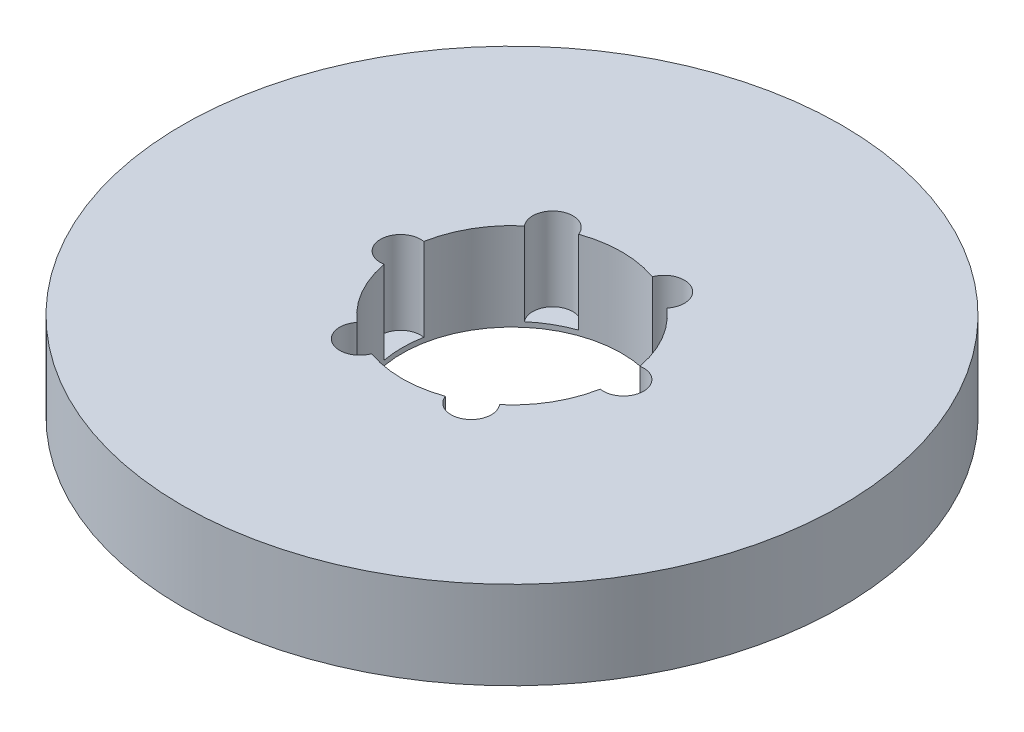
ISO-10303-21;
HEADER;
FILE_DESCRIPTION(('STEP AP214'),'2;1');
FILE_NAME('part.step','',(''),(''),'','','');
FILE_SCHEMA(('AUTOMOTIVE_DESIGN { 1 0 10303 214 1 1 1 1 }'));
ENDSEC;
DATA;
#1=APPLICATION_CONTEXT('core data for automotive mechanical design processes');
#2=APPLICATION_PROTOCOL_DEFINITION('international standard','automotive_design',2000,#1);
#3=PRODUCT_CONTEXT('',#1,'mechanical');
#4=PRODUCT('Part','Part','',(#3));
#5=PRODUCT_RELATED_PRODUCT_CATEGORY('part','',(#4));
#6=PRODUCT_DEFINITION_FORMATION('','',#4);
#7=PRODUCT_DEFINITION_CONTEXT('part definition',#1,'design');
#8=PRODUCT_DEFINITION('design','',#6,#7);
#9=PRODUCT_DEFINITION_SHAPE('','',#8);
#10=(LENGTH_UNIT() NAMED_UNIT(*) SI_UNIT(.MILLI.,.METRE.));
#11=(NAMED_UNIT(*) PLANE_ANGLE_UNIT() SI_UNIT($,.RADIAN.));
#12=(NAMED_UNIT(*) SI_UNIT($,.STERADIAN.) SOLID_ANGLE_UNIT());
#13=UNCERTAINTY_MEASURE_WITH_UNIT(LENGTH_MEASURE(1.E-05),#10,'distance_accuracy_value','');
#14=(GEOMETRIC_REPRESENTATION_CONTEXT(3) GLOBAL_UNCERTAINTY_ASSIGNED_CONTEXT((#13)) GLOBAL_UNIT_ASSIGNED_CONTEXT((#10,
#11,#12)) REPRESENTATION_CONTEXT('',''));
#15=CARTESIAN_POINT('',(0.,0.,0.));
#16=DIRECTION('',(0.,0.,1.));
#17=DIRECTION('',(1.,0.,0.));
#18=AXIS2_PLACEMENT_3D('',#15,#16,#17);
#19=CARTESIAN_POINT('',(0.,20.,0.));
#20=DIRECTION('',(0.,-1.,0.));
#21=DIRECTION('',(0.,0.,-1.));
#22=AXIS2_PLACEMENT_3D('',#19,#20,#21);
#23=CYLINDRICAL_SURFACE('',#22,75.);
#24=CARTESIAN_POINT('',(0.,20.,0.));
#25=DIRECTION('',(0.,1.,0.));
#26=DIRECTION('',(0.,0.,1.));
#27=AXIS2_PLACEMENT_3D('',#24,#25,#26);
#28=CIRCLE('',#27,75.);
#29=CARTESIAN_POINT('',(0.,20.,75.));
#30=VERTEX_POINT('',#29);
#31=EDGE_CURVE('E171',#30,#30,#28,.T.);
#32=ORIENTED_EDGE('',*,*,#31,.F.);
#33=EDGE_LOOP('',(#32));
#34=FACE_BOUND('',#33,.T.);
#35=CARTESIAN_POINT('',(0.,0.,0.));
#36=DIRECTION('',(0.,1.,0.));
#37=DIRECTION('',(0.,0.,1.));
#38=AXIS2_PLACEMENT_3D('',#35,#36,#37);
#39=CIRCLE('',#38,75.);
#40=CARTESIAN_POINT('',(0.,0.,75.));
#41=VERTEX_POINT('',#40);
#42=EDGE_CURVE('E157',#41,#41,#39,.T.);
#43=ORIENTED_EDGE('',*,*,#42,.T.);
#44=EDGE_LOOP('',(#43));
#45=FACE_BOUND('',#44,.T.);
#46=ADVANCED_FACE('F39',(#34,#45),#23,.T.);
#47=CARTESIAN_POINT('',(0.,20.,0.));
#48=DIRECTION('',(0.,1.,0.));
#49=DIRECTION('',(0.,0.,1.));
#50=AXIS2_PLACEMENT_3D('',#47,#48,#49);
#51=PLANE('',#50);
#52=CARTESIAN_POINT('',(-12.678276204944,20.,-21.9594185393539));
#53=DIRECTION('',(0.,1.,0.));
#54=DIRECTION('',(-0.866025403784433,0.,0.50000000000001));
#55=AXIS2_PLACEMENT_3D('',#52,#53,#54);
#56=CIRCLE('',#55,4.58268686041402);
#57=CARTESIAN_POINT('',(-8.38162527491483,20.,-23.5530965639533));
#58=VERTEX_POINT('',#57);
#59=CARTESIAN_POINT('',(-16.2067673247146,20.,-19.0352486950542));
#60=VERTEX_POINT('',#59);
#61=EDGE_CURVE('E214',#58,#60,#56,.T.);
#62=ORIENTED_EDGE('',*,*,#61,.F.);
#63=CARTESIAN_POINT('',(0.,20.,0.));
#64=DIRECTION('',(0.,1.,0.));
#65=DIRECTION('',(0.,0.,1.));
#66=AXIS2_PLACEMENT_3D('',#63,#64,#65);
#67=CIRCLE('',#66,25.);
#68=CARTESIAN_POINT('',(8.38162527491434,20.,-23.5530965639535));
#69=VERTEX_POINT('',#68);
#70=EDGE_CURVE('E272',#69,#58,#67,.T.);
#71=ORIENTED_EDGE('',*,*,#70,.F.);
#72=CARTESIAN_POINT('',(12.6782762049435,20.,-21.9594185393541));
#73=DIRECTION('',(0.,1.,0.));
#74=DIRECTION('',(-0.866025403784443,0.,-0.499999999999992));
#75=AXIS2_PLACEMENT_3D('',#72,#73,#74);
#76=CIRCLE('',#75,4.58268686041402);
#77=CARTESIAN_POINT('',(16.2067673247142,20.,-19.0352486950546));
#78=VERTEX_POINT('',#77);
#79=EDGE_CURVE('E285',#78,#69,#76,.T.);
#80=ORIENTED_EDGE('',*,*,#79,.F.);
#81=CARTESIAN_POINT('',(24.5883925996289,20.,-4.51784786889897));
#82=VERTEX_POINT('',#81);
#83=EDGE_CURVE('E165',#82,#78,#67,.T.);
#84=ORIENTED_EDGE('',*,*,#83,.F.);
#85=CARTESIAN_POINT('',(25.3565524098874,20.,0.));
#86=DIRECTION('',(0.,1.,0.));
#87=DIRECTION('',(0.,0.,-1.));
#88=AXIS2_PLACEMENT_3D('',#85,#86,#87);
#89=CIRCLE('',#88,4.58268686041402);
#90=CARTESIAN_POINT('',(24.5883925996289,20.,4.51784786889897));
#91=VERTEX_POINT('',#90);
#92=EDGE_CURVE('E281',#91,#82,#89,.T.);
#93=ORIENTED_EDGE('',*,*,#92,.F.);
#94=CARTESIAN_POINT('',(16.2067673247144,20.,19.0352486950544));
#95=VERTEX_POINT('',#94);
#96=EDGE_CURVE('E160',#95,#91,#67,.T.);
#97=ORIENTED_EDGE('',*,*,#96,.F.);
#98=CARTESIAN_POINT('',(12.6782762049438,20.,21.9594185393539));
#99=DIRECTION('',(0.,1.,0.));
#100=DIRECTION('',(0.866025403784436,0.,-0.500000000000004));
#101=AXIS2_PLACEMENT_3D('',#98,#99,#100);
#102=CIRCLE('',#101,4.58268686041402);
#103=CARTESIAN_POINT('',(8.38162527491467,20.,23.5530965639534));
#104=VERTEX_POINT('',#103);
#105=EDGE_CURVE('E154',#104,#95,#102,.T.);
#106=ORIENTED_EDGE('',*,*,#105,.F.);
#107=CARTESIAN_POINT('',(-8.3816252749145,20.,23.5530965639534));
#108=VERTEX_POINT('',#107);
#109=EDGE_CURVE('E150',#108,#104,#67,.T.);
#110=ORIENTED_EDGE('',*,*,#109,.F.);
#111=CARTESIAN_POINT('',(-12.6782762049436,20.,21.959418539354));
#112=DIRECTION('',(0.,1.,0.));
#113=DIRECTION('',(0.86602540378444,0.,0.499999999999998));
#114=AXIS2_PLACEMENT_3D('',#111,#112,#113);
#115=CIRCLE('',#114,4.58268686041402);
#116=CARTESIAN_POINT('',(-16.2067673247143,20.,19.0352486950545));
#117=VERTEX_POINT('',#116);
#118=EDGE_CURVE('E127',#117,#108,#115,.T.);
#119=ORIENTED_EDGE('',*,*,#118,.F.);
#120=CARTESIAN_POINT('',(-24.5883925996289,20.,4.51784786889897));
#121=VERTEX_POINT('',#120);
#122=EDGE_CURVE('E156',#121,#117,#67,.T.);
#123=ORIENTED_EDGE('',*,*,#122,.F.);
#124=CARTESIAN_POINT('',(-25.3565524098874,20.,0.));
#125=DIRECTION('',(0.,1.,0.));
#126=DIRECTION('',(0.,0.,1.));
#127=AXIS2_PLACEMENT_3D('',#124,#125,#126);
#128=CIRCLE('',#127,4.58268686041402);
#129=CARTESIAN_POINT('',(-24.5883925996289,20.,-4.51784786889897));
#130=VERTEX_POINT('',#129);
#131=EDGE_CURVE('E164',#130,#121,#128,.T.);
#132=ORIENTED_EDGE('',*,*,#131,.F.);
#133=EDGE_CURVE('E159',#60,#130,#67,.T.);
#134=ORIENTED_EDGE('',*,*,#133,.F.);
#135=EDGE_LOOP('',(#62,#71,#80,#84,#93,#97,#106,#110,#119,#123,#132,#134));
#136=FACE_BOUND('',#135,.T.);
#137=ORIENTED_EDGE('',*,*,#31,.T.);
#138=EDGE_LOOP('',(#137));
#139=FACE_BOUND('',#138,.T.);
#140=ADVANCED_FACE('F155',(#136,#139),#51,.T.);
#141=CARTESIAN_POINT('',(0.,0.,0.));
#142=DIRECTION('',(0.,1.,0.));
#143=DIRECTION('',(0.,0.,1.));
#144=AXIS2_PLACEMENT_3D('',#141,#142,#143);
#145=PLANE('',#144);
#146=CARTESIAN_POINT('',(0.,0.,0.));
#147=DIRECTION('',(0.,1.,0.));
#148=DIRECTION('',(0.,0.,1.));
#149=AXIS2_PLACEMENT_3D('',#146,#147,#148);
#150=CIRCLE('',#149,25.);
#151=CARTESIAN_POINT('',(0.,0.,25.));
#152=VERTEX_POINT('',#151);
#153=EDGE_CURVE('E170',#152,#152,#150,.T.);
#154=ORIENTED_EDGE('',*,*,#153,.T.);
#155=EDGE_LOOP('',(#154));
#156=FACE_BOUND('',#155,.T.);
#157=ORIENTED_EDGE('',*,*,#42,.F.);
#158=EDGE_LOOP('',(#157));
#159=FACE_BOUND('',#158,.T.);
#160=ADVANCED_FACE('F232',(#156,#159),#145,.F.);
#161=CARTESIAN_POINT('',(0.,20.,0.));
#162=DIRECTION('',(0.,-1.,0.));
#163=DIRECTION('',(0.,0.,-1.));
#164=AXIS2_PLACEMENT_3D('',#161,#162,#163);
#165=CYLINDRICAL_SURFACE('',#164,25.);
#166=DIRECTION('',(0.,1.,0.));
#167=VECTOR('',#166,1.);
#168=CARTESIAN_POINT('',(-8.38162527491483,10.5550217880143,-23.5530965639533));
#169=LINE('',#168,#167);
#170=CARTESIAN_POINT('',(-8.38162527491483,1.11004357602867,-23.5530965639533));
#171=VERTEX_POINT('',#170);
#172=EDGE_CURVE('E11',#171,#58,#169,.T.);
#173=ORIENTED_EDGE('',*,*,#172,.F.);
#174=CARTESIAN_POINT('',(0.,1.11004357602867,0.));
#175=DIRECTION('',(0.,1.,0.));
#176=DIRECTION('',(0.,0.,1.));
#177=AXIS2_PLACEMENT_3D('',#174,#175,#176);
#178=CIRCLE('',#177,25.);
#179=CARTESIAN_POINT('',(-16.2067673247146,1.11004357602867,-19.0352486950542));
#180=VERTEX_POINT('',#179);
#181=EDGE_CURVE('E209',#171,#180,#178,.T.);
#182=ORIENTED_EDGE('',*,*,#181,.T.);
#183=DIRECTION('',(0.,1.,0.));
#184=VECTOR('',#183,1.);
#185=CARTESIAN_POINT('',(-16.2067673247146,10.5550217880143,-19.0352486950542));
#186=LINE('',#185,#184);
#187=EDGE_CURVE('E46',#60,#180,#186,.F.);
#188=ORIENTED_EDGE('',*,*,#187,.F.);
#189=ORIENTED_EDGE('',*,*,#133,.T.);
#190=DIRECTION('',(0.,1.,0.));
#191=VECTOR('',#190,1.);
#192=CARTESIAN_POINT('',(-24.5883925996289,10.5550217880143,-4.51784786889897));
#193=LINE('',#192,#191);
#194=CARTESIAN_POINT('',(-24.5883925996289,1.11004357602867,-4.51784786889897));
#195=VERTEX_POINT('',#194);
#196=EDGE_CURVE('E185',#195,#130,#193,.T.);
#197=ORIENTED_EDGE('',*,*,#196,.F.);
#198=CARTESIAN_POINT('',(0.,1.11004357602867,0.));
#199=DIRECTION('',(0.,1.,0.));
#200=DIRECTION('',(0.,0.,1.));
#201=AXIS2_PLACEMENT_3D('',#198,#199,#200);
#202=CIRCLE('',#201,25.);
#203=CARTESIAN_POINT('',(-24.5883925996289,1.11004357602867,4.51784786889897));
#204=VERTEX_POINT('',#203);
#205=EDGE_CURVE('E173',#195,#204,#202,.T.);
#206=ORIENTED_EDGE('',*,*,#205,.T.);
#207=DIRECTION('',(0.,1.,0.));
#208=VECTOR('',#207,1.);
#209=CARTESIAN_POINT('',(-24.5883925996289,10.5550217880143,4.51784786889897));
#210=LINE('',#209,#208);
#211=EDGE_CURVE('E178',#121,#204,#210,.F.);
#212=ORIENTED_EDGE('',*,*,#211,.F.);
#213=ORIENTED_EDGE('',*,*,#122,.T.);
#214=DIRECTION('',(0.,1.,0.));
#215=VECTOR('',#214,1.);
#216=CARTESIAN_POINT('',(-16.2067673247143,10.5550217880143,19.0352486950545));
#217=LINE('',#216,#215);
#218=CARTESIAN_POINT('',(-16.2067673247143,1.11004357602867,19.0352486950545));
#219=VERTEX_POINT('',#218);
#220=EDGE_CURVE('E132',#219,#117,#217,.T.);
#221=ORIENTED_EDGE('',*,*,#220,.F.);
#222=CARTESIAN_POINT('',(0.,1.11004357602867,0.));
#223=DIRECTION('',(0.,1.,0.));
#224=DIRECTION('',(0.,0.,1.));
#225=AXIS2_PLACEMENT_3D('',#222,#223,#224);
#226=CIRCLE('',#225,25.);
#227=CARTESIAN_POINT('',(-8.3816252749145,1.11004357602867,23.5530965639534));
#228=VERTEX_POINT('',#227);
#229=EDGE_CURVE('E146',#219,#228,#226,.T.);
#230=ORIENTED_EDGE('',*,*,#229,.T.);
#231=DIRECTION('',(0.,1.,0.));
#232=VECTOR('',#231,1.);
#233=CARTESIAN_POINT('',(-8.3816252749145,10.5550217880143,23.5530965639534));
#234=LINE('',#233,#232);
#235=EDGE_CURVE('E128',#108,#228,#234,.F.);
#236=ORIENTED_EDGE('',*,*,#235,.F.);
#237=ORIENTED_EDGE('',*,*,#109,.T.);
#238=DIRECTION('',(0.,1.,0.));
#239=VECTOR('',#238,1.);
#240=CARTESIAN_POINT('',(8.38162527491467,10.5550217880143,23.5530965639534));
#241=LINE('',#240,#239);
#242=CARTESIAN_POINT('',(8.38162527491467,1.11004357602867,23.5530965639534));
#243=VERTEX_POINT('',#242);
#244=EDGE_CURVE('E192',#243,#104,#241,.T.);
#245=ORIENTED_EDGE('',*,*,#244,.F.);
#246=CARTESIAN_POINT('',(0.,1.11004357602867,0.));
#247=DIRECTION('',(0.,1.,0.));
#248=DIRECTION('',(0.,0.,1.));
#249=AXIS2_PLACEMENT_3D('',#246,#247,#248);
#250=CIRCLE('',#249,25.);
#251=CARTESIAN_POINT('',(16.2067673247144,1.11004357602867,19.0352486950544));
#252=VERTEX_POINT('',#251);
#253=EDGE_CURVE('E190',#243,#252,#250,.T.);
#254=ORIENTED_EDGE('',*,*,#253,.T.);
#255=DIRECTION('',(0.,1.,0.));
#256=VECTOR('',#255,1.);
#257=CARTESIAN_POINT('',(16.2067673247144,10.5550217880143,19.0352486950544));
#258=LINE('',#257,#256);
#259=EDGE_CURVE('E189',#95,#252,#258,.F.);
#260=ORIENTED_EDGE('',*,*,#259,.F.);
#261=ORIENTED_EDGE('',*,*,#96,.T.);
#262=DIRECTION('',(0.,1.,0.));
#263=VECTOR('',#262,1.);
#264=CARTESIAN_POINT('',(24.5883925996289,10.5550217880143,4.51784786889897));
#265=LINE('',#264,#263);
#266=CARTESIAN_POINT('',(24.5883925996289,1.11004357602867,4.51784786889897));
#267=VERTEX_POINT('',#266);
#268=EDGE_CURVE('E203',#267,#91,#265,.T.);
#269=ORIENTED_EDGE('',*,*,#268,.F.);
#270=CARTESIAN_POINT('',(0.,1.11004357602867,0.));
#271=DIRECTION('',(0.,1.,0.));
#272=DIRECTION('',(0.,0.,1.));
#273=AXIS2_PLACEMENT_3D('',#270,#271,#272);
#274=CIRCLE('',#273,25.);
#275=CARTESIAN_POINT('',(24.5883925996289,1.11004357602867,-4.51784786889897));
#276=VERTEX_POINT('',#275);
#277=EDGE_CURVE('E194',#267,#276,#274,.T.);
#278=ORIENTED_EDGE('',*,*,#277,.T.);
#279=DIRECTION('',(0.,1.,0.));
#280=VECTOR('',#279,1.);
#281=CARTESIAN_POINT('',(24.5883925996289,10.5550217880143,-4.51784786889897));
#282=LINE('',#281,#280);
#283=EDGE_CURVE('E196',#82,#276,#282,.F.);
#284=ORIENTED_EDGE('',*,*,#283,.F.);
#285=ORIENTED_EDGE('',*,*,#83,.T.);
#286=DIRECTION('',(0.,1.,0.));
#287=VECTOR('',#286,1.);
#288=CARTESIAN_POINT('',(16.2067673247142,10.5550217880143,-19.0352486950546));
#289=LINE('',#288,#287);
#290=CARTESIAN_POINT('',(16.2067673247142,1.11004357602867,-19.0352486950546));
#291=VERTEX_POINT('',#290);
#292=EDGE_CURVE('E208',#291,#78,#289,.T.);
#293=ORIENTED_EDGE('',*,*,#292,.F.);
#294=CARTESIAN_POINT('',(0.,1.11004357602867,0.));
#295=DIRECTION('',(0.,1.,0.));
#296=DIRECTION('',(0.,0.,1.));
#297=AXIS2_PLACEMENT_3D('',#294,#295,#296);
#298=CIRCLE('',#297,25.);
#299=CARTESIAN_POINT('',(8.38162527491434,1.11004357602867,-23.5530965639535));
#300=VERTEX_POINT('',#299);
#301=EDGE_CURVE('E201',#291,#300,#298,.T.);
#302=ORIENTED_EDGE('',*,*,#301,.T.);
#303=DIRECTION('',(0.,1.,0.));
#304=VECTOR('',#303,1.);
#305=CARTESIAN_POINT('',(8.38162527491434,10.5550217880143,-23.5530965639535));
#306=LINE('',#305,#304);
#307=EDGE_CURVE('E206',#69,#300,#306,.F.);
#308=ORIENTED_EDGE('',*,*,#307,.F.);
#309=ORIENTED_EDGE('',*,*,#70,.T.);
#310=EDGE_LOOP('',(#173,#182,#188,#189,#197,#206,#212,#213,#221,#230,#236,#237,#245,#254,#260,
#261,#269,#278,#284,#285,#293,#302,#308,#309));
#311=FACE_BOUND('',#310,.T.);
#312=ORIENTED_EDGE('',*,*,#153,.F.);
#313=EDGE_LOOP('',(#312));
#314=FACE_BOUND('',#313,.T.);
#315=ADVANCED_FACE('F145',(#311,#314),#165,.F.);
#316=CARTESIAN_POINT('',(-25.3565524098874,1.11004357602867,0.));
#317=DIRECTION('',(0.,1.,0.));
#318=DIRECTION('',(0.,0.,1.));
#319=AXIS2_PLACEMENT_3D('',#316,#317,#318);
#320=CYLINDRICAL_SURFACE('',#319,4.58268686041402);
#321=ORIENTED_EDGE('',*,*,#196,.T.);
#322=ORIENTED_EDGE('',*,*,#131,.T.);
#323=ORIENTED_EDGE('',*,*,#211,.T.);
#324=CARTESIAN_POINT('',(-25.3565524098874,1.11004357602867,0.));
#325=DIRECTION('',(0.,1.,0.));
#326=DIRECTION('',(0.,0.,1.));
#327=AXIS2_PLACEMENT_3D('',#324,#325,#326);
#328=CIRCLE('',#327,4.58268686041402);
#329=EDGE_CURVE('E168',#195,#204,#328,.T.);
#330=ORIENTED_EDGE('',*,*,#329,.F.);
#331=EDGE_LOOP('',(#321,#322,#323,#330));
#332=FACE_BOUND('',#331,.T.);
#333=ADVANCED_FACE('F243',(#332),#320,.F.);
#334=CARTESIAN_POINT('',(-25.3565524098874,1.11004357602867,0.));
#335=DIRECTION('',(0.,1.,0.));
#336=DIRECTION('',(0.,0.,1.));
#337=AXIS2_PLACEMENT_3D('',#334,#335,#336);
#338=PLANE('',#337);
#339=ORIENTED_EDGE('',*,*,#329,.T.);
#340=ORIENTED_EDGE('',*,*,#205,.F.);
#341=EDGE_LOOP('',(#339,#340));
#342=FACE_BOUND('',#341,.T.);
#343=ADVANCED_FACE('F247',(#342),#338,.T.);
#344=CARTESIAN_POINT('',(-12.6782762049436,1.11004357602867,21.959418539354));
#345=DIRECTION('',(0.,1.,0.));
#346=DIRECTION('',(0.,0.,1.));
#347=AXIS2_PLACEMENT_3D('',#344,#345,#346);
#348=CYLINDRICAL_SURFACE('',#347,4.58268686041402);
#349=ORIENTED_EDGE('',*,*,#220,.T.);
#350=ORIENTED_EDGE('',*,*,#118,.T.);
#351=ORIENTED_EDGE('',*,*,#235,.T.);
#352=CARTESIAN_POINT('',(-12.6782762049436,1.11004357602867,21.959418539354));
#353=DIRECTION('',(0.,1.,0.));
#354=DIRECTION('',(0.86602540378444,0.,0.499999999999998));
#355=AXIS2_PLACEMENT_3D('',#352,#353,#354);
#356=CIRCLE('',#355,4.58268686041402);
#357=EDGE_CURVE('E137',#219,#228,#356,.T.);
#358=ORIENTED_EDGE('',*,*,#357,.F.);
#359=EDGE_LOOP('',(#349,#350,#351,#358));
#360=FACE_BOUND('',#359,.T.);
#361=ADVANCED_FACE('F126',(#360),#348,.F.);
#362=CARTESIAN_POINT('',(-12.6782762049436,1.11004357602867,21.959418539354));
#363=DIRECTION('',(0.,1.,0.));
#364=DIRECTION('',(0.86602540378444,0.,0.499999999999998));
#365=AXIS2_PLACEMENT_3D('',#362,#363,#364);
#366=PLANE('',#365);
#367=ORIENTED_EDGE('',*,*,#357,.T.);
#368=ORIENTED_EDGE('',*,*,#229,.F.);
#369=EDGE_LOOP('',(#367,#368));
#370=FACE_BOUND('',#369,.T.);
#371=ADVANCED_FACE('F254',(#370),#366,.T.);
#372=CARTESIAN_POINT('',(12.6782762049438,1.11004357602867,21.9594185393539));
#373=DIRECTION('',(0.,1.,0.));
#374=DIRECTION('',(0.,0.,1.));
#375=AXIS2_PLACEMENT_3D('',#372,#373,#374);
#376=CYLINDRICAL_SURFACE('',#375,4.58268686041402);
#377=ORIENTED_EDGE('',*,*,#244,.T.);
#378=ORIENTED_EDGE('',*,*,#105,.T.);
#379=ORIENTED_EDGE('',*,*,#259,.T.);
#380=CARTESIAN_POINT('',(12.6782762049438,1.11004357602867,21.9594185393539));
#381=DIRECTION('',(0.,1.,0.));
#382=DIRECTION('',(0.866025403784436,0.,-0.500000000000004));
#383=AXIS2_PLACEMENT_3D('',#380,#381,#382);
#384=CIRCLE('',#383,4.58268686041402);
#385=EDGE_CURVE('E138',#243,#252,#384,.T.);
#386=ORIENTED_EDGE('',*,*,#385,.F.);
#387=EDGE_LOOP('',(#377,#378,#379,#386));
#388=FACE_BOUND('',#387,.T.);
#389=ADVANCED_FACE('F260',(#388),#376,.F.);
#390=CARTESIAN_POINT('',(12.6782762049438,1.11004357602867,21.9594185393539));
#391=DIRECTION('',(0.,1.,0.));
#392=DIRECTION('',(0.866025403784436,0.,-0.500000000000004));
#393=AXIS2_PLACEMENT_3D('',#390,#391,#392);
#394=PLANE('',#393);
#395=ORIENTED_EDGE('',*,*,#385,.T.);
#396=ORIENTED_EDGE('',*,*,#253,.F.);
#397=EDGE_LOOP('',(#395,#396));
#398=FACE_BOUND('',#397,.T.);
#399=ADVANCED_FACE('F265',(#398),#394,.T.);
#400=CARTESIAN_POINT('',(25.3565524098874,1.11004357602867,0.));
#401=DIRECTION('',(0.,1.,0.));
#402=DIRECTION('',(0.,0.,1.));
#403=AXIS2_PLACEMENT_3D('',#400,#401,#402);
#404=CYLINDRICAL_SURFACE('',#403,4.58268686041402);
#405=ORIENTED_EDGE('',*,*,#268,.T.);
#406=ORIENTED_EDGE('',*,*,#92,.T.);
#407=ORIENTED_EDGE('',*,*,#283,.T.);
#408=CARTESIAN_POINT('',(25.3565524098874,1.11004357602867,0.));
#409=DIRECTION('',(0.,1.,0.));
#410=DIRECTION('',(0.,0.,-1.));
#411=AXIS2_PLACEMENT_3D('',#408,#409,#410);
#412=CIRCLE('',#411,4.58268686041402);
#413=EDGE_CURVE('E287',#267,#276,#412,.T.);
#414=ORIENTED_EDGE('',*,*,#413,.F.);
#415=EDGE_LOOP('',(#405,#406,#407,#414));
#416=FACE_BOUND('',#415,.T.);
#417=ADVANCED_FACE('F300',(#416),#404,.F.);
#418=CARTESIAN_POINT('',(25.3565524098874,1.11004357602867,0.));
#419=DIRECTION('',(0.,1.,0.));
#420=DIRECTION('',(0.,0.,-1.));
#421=AXIS2_PLACEMENT_3D('',#418,#419,#420);
#422=PLANE('',#421);
#423=ORIENTED_EDGE('',*,*,#413,.T.);
#424=ORIENTED_EDGE('',*,*,#277,.F.);
#425=EDGE_LOOP('',(#423,#424));
#426=FACE_BOUND('',#425,.T.);
#427=ADVANCED_FACE('F298',(#426),#422,.T.);
#428=CARTESIAN_POINT('',(12.6782762049435,1.11004357602867,-21.9594185393541));
#429=DIRECTION('',(0.,1.,0.));
#430=DIRECTION('',(0.,0.,1.));
#431=AXIS2_PLACEMENT_3D('',#428,#429,#430);
#432=CYLINDRICAL_SURFACE('',#431,4.58268686041402);
#433=ORIENTED_EDGE('',*,*,#292,.T.);
#434=ORIENTED_EDGE('',*,*,#79,.T.);
#435=ORIENTED_EDGE('',*,*,#307,.T.);
#436=CARTESIAN_POINT('',(12.6782762049435,1.11004357602867,-21.9594185393541));
#437=DIRECTION('',(0.,1.,0.));
#438=DIRECTION('',(-0.866025403784443,0.,-0.499999999999992));
#439=AXIS2_PLACEMENT_3D('',#436,#437,#438);
#440=CIRCLE('',#439,4.58268686041402);
#441=EDGE_CURVE('E56',#291,#300,#440,.T.);
#442=ORIENTED_EDGE('',*,*,#441,.F.);
#443=EDGE_LOOP('',(#433,#434,#435,#442));
#444=FACE_BOUND('',#443,.T.);
#445=ADVANCED_FACE('F301',(#444),#432,.F.);
#446=CARTESIAN_POINT('',(12.6782762049435,1.11004357602867,-21.9594185393541));
#447=DIRECTION('',(0.,1.,0.));
#448=DIRECTION('',(-0.866025403784443,0.,-0.499999999999992));
#449=AXIS2_PLACEMENT_3D('',#446,#447,#448);
#450=PLANE('',#449);
#451=ORIENTED_EDGE('',*,*,#441,.T.);
#452=ORIENTED_EDGE('',*,*,#301,.F.);
#453=EDGE_LOOP('',(#451,#452));
#454=FACE_BOUND('',#453,.T.);
#455=ADVANCED_FACE('F221',(#454),#450,.T.);
#456=CARTESIAN_POINT('',(-12.678276204944,1.11004357602867,-21.9594185393539));
#457=DIRECTION('',(0.,1.,0.));
#458=DIRECTION('',(0.,0.,1.));
#459=AXIS2_PLACEMENT_3D('',#456,#457,#458);
#460=CYLINDRICAL_SURFACE('',#459,4.58268686041402);
#461=ORIENTED_EDGE('',*,*,#172,.T.);
#462=ORIENTED_EDGE('',*,*,#61,.T.);
#463=ORIENTED_EDGE('',*,*,#187,.T.);
#464=CARTESIAN_POINT('',(-12.678276204944,1.11004357602867,-21.9594185393539));
#465=DIRECTION('',(0.,1.,0.));
#466=DIRECTION('',(-0.866025403784433,0.,0.50000000000001));
#467=AXIS2_PLACEMENT_3D('',#464,#465,#466);
#468=CIRCLE('',#467,4.58268686041402);
#469=EDGE_CURVE('E55',#171,#180,#468,.T.);
#470=ORIENTED_EDGE('',*,*,#469,.F.);
#471=EDGE_LOOP('',(#461,#462,#463,#470));
#472=FACE_BOUND('',#471,.T.);
#473=ADVANCED_FACE('F212',(#472),#460,.F.);
#474=CARTESIAN_POINT('',(-12.678276204944,1.11004357602867,-21.9594185393539));
#475=DIRECTION('',(0.,1.,0.));
#476=DIRECTION('',(-0.866025403784433,0.,0.50000000000001));
#477=AXIS2_PLACEMENT_3D('',#474,#475,#476);
#478=PLANE('',#477);
#479=ORIENTED_EDGE('',*,*,#469,.T.);
#480=ORIENTED_EDGE('',*,*,#181,.F.);
#481=EDGE_LOOP('',(#479,#480));
#482=FACE_BOUND('',#481,.T.);
#483=ADVANCED_FACE('F217',(#482),#478,.T.);
#484=CLOSED_SHELL('',(#46,#140,#160,#315,#333,#343,#361,#371,#389,#399,#417,#427,#445,#455,#473,#483));
#485=MANIFOLD_SOLID_BREP('B2',#484);
#486=ADVANCED_BREP_SHAPE_REPRESENTATION('',(#18,#485),#14);
#487=SHAPE_DEFINITION_REPRESENTATION(#9,#486);
ENDSEC;
END-ISO-10303-21;
